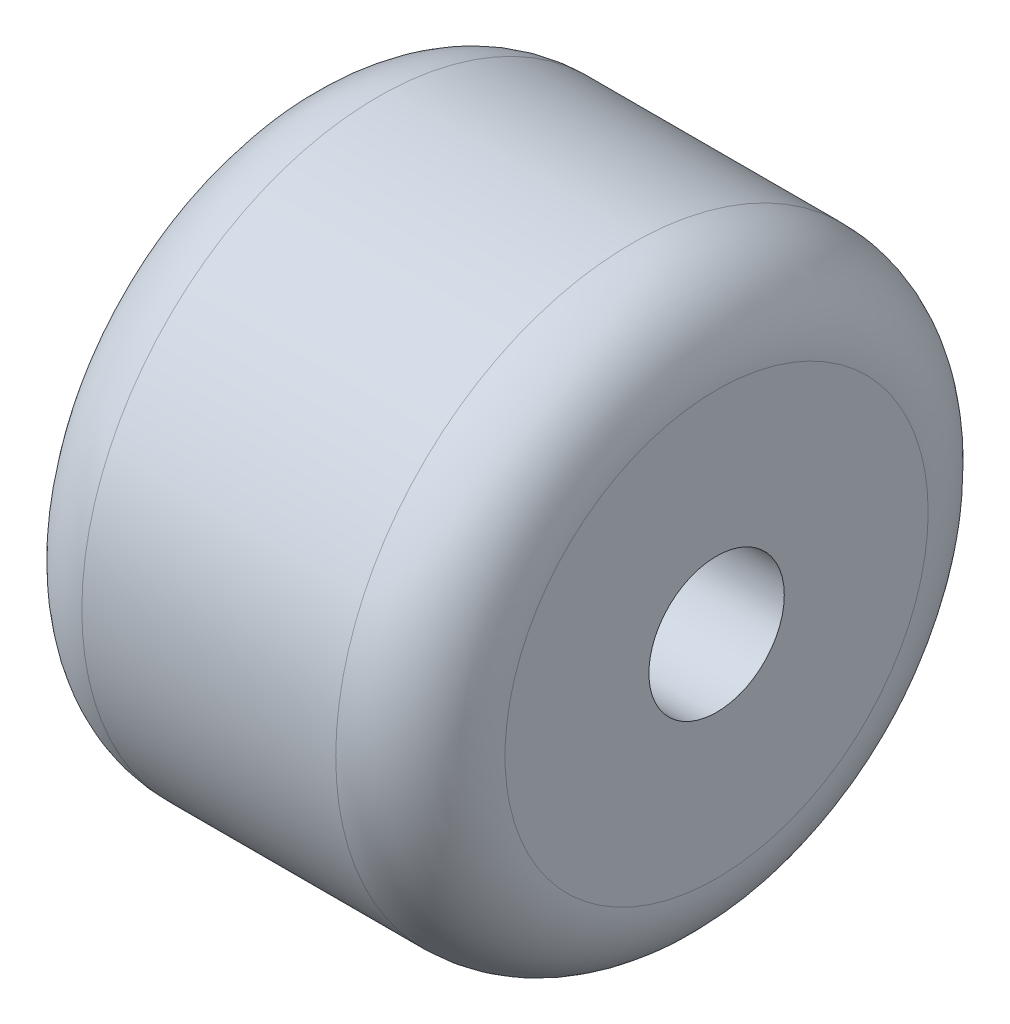
ISO-10303-21;
HEADER;
FILE_DESCRIPTION(('STEP AP214'),'2;1');
FILE_NAME('part.step','',(''),(''),'','','');
FILE_SCHEMA(('AUTOMOTIVE_DESIGN { 1 0 10303 214 1 1 1 1 }'));
ENDSEC;
DATA;
#1=APPLICATION_CONTEXT('core data for automotive mechanical design processes');
#2=APPLICATION_PROTOCOL_DEFINITION('international standard','automotive_design',2000,#1);
#3=PRODUCT_CONTEXT('',#1,'mechanical');
#4=PRODUCT('Part','Part','',(#3));
#5=PRODUCT_RELATED_PRODUCT_CATEGORY('part','',(#4));
#6=PRODUCT_DEFINITION_FORMATION('','',#4);
#7=PRODUCT_DEFINITION_CONTEXT('part definition',#1,'design');
#8=PRODUCT_DEFINITION('design','',#6,#7);
#9=PRODUCT_DEFINITION_SHAPE('','',#8);
#10=(LENGTH_UNIT() NAMED_UNIT(*) SI_UNIT(.MILLI.,.METRE.));
#11=(NAMED_UNIT(*) PLANE_ANGLE_UNIT() SI_UNIT($,.RADIAN.));
#12=(NAMED_UNIT(*) SI_UNIT($,.STERADIAN.) SOLID_ANGLE_UNIT());
#13=UNCERTAINTY_MEASURE_WITH_UNIT(LENGTH_MEASURE(1.E-05),#10,'distance_accuracy_value','');
#14=(GEOMETRIC_REPRESENTATION_CONTEXT(3) GLOBAL_UNCERTAINTY_ASSIGNED_CONTEXT((#13)) GLOBAL_UNIT_ASSIGNED_CONTEXT((#10,
#11,#12)) REPRESENTATION_CONTEXT('',''));
#15=CARTESIAN_POINT('',(0.,0.,0.));
#16=DIRECTION('',(0.,0.,1.));
#17=DIRECTION('',(1.,0.,0.));
#18=AXIS2_PLACEMENT_3D('',#15,#16,#17);
#19=CARTESIAN_POINT('',(25.,0.,0.));
#20=DIRECTION('',(1.,0.,0.));
#21=DIRECTION('',(0.,0.,-1.));
#22=AXIS2_PLACEMENT_3D('',#19,#20,#21);
#23=PLANE('',#22);
#24=CARTESIAN_POINT('',(25.,0.,0.));
#25=DIRECTION('',(1.,0.,0.));
#26=DIRECTION('',(0.,0.,-1.));
#27=AXIS2_PLACEMENT_3D('',#24,#25,#26);
#28=CIRCLE('',#27,12.5);
#29=CARTESIAN_POINT('',(25.,0.,-12.5));
#30=VERTEX_POINT('',#29);
#31=EDGE_CURVE('E10',#30,#30,#28,.T.);
#32=ORIENTED_EDGE('',*,*,#31,.T.);
#33=EDGE_LOOP('',(#32));
#34=FACE_BOUND('',#33,.T.);
#35=CARTESIAN_POINT('',(25.,0.,0.));
#36=DIRECTION('',(1.,0.,0.));
#37=DIRECTION('',(0.,0.,-1.));
#38=AXIS2_PLACEMENT_3D('',#35,#36,#37);
#39=CIRCLE('',#38,4.);
#40=CARTESIAN_POINT('',(25.,0.,-4.));
#41=VERTEX_POINT('',#40);
#42=EDGE_CURVE('E61',#41,#41,#39,.T.);
#43=ORIENTED_EDGE('',*,*,#42,.F.);
#44=EDGE_LOOP('',(#43));
#45=FACE_BOUND('',#44,.T.);
#46=ADVANCED_FACE('F37',(#34,#45),#23,.T.);
#47=CARTESIAN_POINT('',(0.,0.,0.));
#48=DIRECTION('',(1.,0.,0.));
#49=DIRECTION('',(0.,0.,-1.));
#50=AXIS2_PLACEMENT_3D('',#47,#48,#49);
#51=PLANE('',#50);
#52=CARTESIAN_POINT('',(0.,0.,0.));
#53=DIRECTION('',(1.,0.,0.));
#54=DIRECTION('',(0.,0.,-1.));
#55=AXIS2_PLACEMENT_3D('',#52,#53,#54);
#56=CIRCLE('',#55,12.5);
#57=CARTESIAN_POINT('',(0.,0.,-12.5));
#58=VERTEX_POINT('',#57);
#59=EDGE_CURVE('E45',#58,#58,#56,.F.);
#60=ORIENTED_EDGE('',*,*,#59,.T.);
#61=EDGE_LOOP('',(#60));
#62=FACE_BOUND('',#61,.T.);
#63=CARTESIAN_POINT('',(0.,0.,0.));
#64=DIRECTION('',(1.,0.,0.));
#65=DIRECTION('',(0.,0.,-1.));
#66=AXIS2_PLACEMENT_3D('',#63,#64,#65);
#67=CIRCLE('',#66,4.);
#68=CARTESIAN_POINT('',(0.,0.,-4.));
#69=VERTEX_POINT('',#68);
#70=EDGE_CURVE('E62',#69,#69,#67,.T.);
#71=ORIENTED_EDGE('',*,*,#70,.T.);
#72=EDGE_LOOP('',(#71));
#73=FACE_BOUND('',#72,.T.);
#74=ADVANCED_FACE('F74',(#62,#73),#51,.F.);
#75=CARTESIAN_POINT('',(25.,0.,0.));
#76=DIRECTION('',(-1.,0.,0.));
#77=DIRECTION('',(0.,0.,1.));
#78=AXIS2_PLACEMENT_3D('',#75,#76,#77);
#79=CYLINDRICAL_SURFACE('',#78,17.5);
#80=CARTESIAN_POINT('',(5.,0.,0.));
#81=DIRECTION('',(1.,0.,0.));
#82=DIRECTION('',(0.,0.,-1.));
#83=AXIS2_PLACEMENT_3D('',#80,#81,#82);
#84=CIRCLE('',#83,17.5);
#85=CARTESIAN_POINT('',(5.,0.,-17.5));
#86=VERTEX_POINT('',#85);
#87=EDGE_CURVE('E50',#86,#86,#84,.T.);
#88=ORIENTED_EDGE('',*,*,#87,.T.);
#89=EDGE_LOOP('',(#88));
#90=FACE_BOUND('',#89,.T.);
#91=CARTESIAN_POINT('',(20.,0.,0.));
#92=DIRECTION('',(1.,0.,0.));
#93=DIRECTION('',(0.,0.,-1.));
#94=AXIS2_PLACEMENT_3D('',#91,#92,#93);
#95=CIRCLE('',#94,17.5);
#96=CARTESIAN_POINT('',(20.,0.,-17.5));
#97=VERTEX_POINT('',#96);
#98=EDGE_CURVE('E55',#97,#97,#95,.F.);
#99=ORIENTED_EDGE('',*,*,#98,.T.);
#100=EDGE_LOOP('',(#99));
#101=FACE_BOUND('',#100,.T.);
#102=ADVANCED_FACE('F79',(#90,#101),#79,.T.);
#103=CARTESIAN_POINT('',(25.,0.,0.));
#104=DIRECTION('',(-1.,0.,0.));
#105=DIRECTION('',(0.,0.,1.));
#106=AXIS2_PLACEMENT_3D('',#103,#104,#105);
#107=CYLINDRICAL_SURFACE('',#106,4.);
#108=ORIENTED_EDGE('',*,*,#42,.T.);
#109=EDGE_LOOP('',(#108));
#110=FACE_BOUND('',#109,.T.);
#111=ORIENTED_EDGE('',*,*,#70,.F.);
#112=EDGE_LOOP('',(#111));
#113=FACE_BOUND('',#112,.T.);
#114=ADVANCED_FACE('F70',(#110,#113),#107,.F.);
#115=CARTESIAN_POINT('',(5.,0.,0.));
#116=DIRECTION('',(1.,0.,0.));
#117=DIRECTION('',(0.,0.,-1.));
#118=AXIS2_PLACEMENT_3D('',#115,#116,#117);
#119=TOROIDAL_SURFACE('',#118,12.5,5.);
#120=ORIENTED_EDGE('',*,*,#59,.F.);
#121=EDGE_LOOP('',(#120));
#122=FACE_BOUND('',#121,.T.);
#123=ORIENTED_EDGE('',*,*,#87,.F.);
#124=EDGE_LOOP('',(#123));
#125=FACE_BOUND('',#124,.T.);
#126=ADVANCED_FACE('F85',(#122,#125),#119,.T.);
#127=CARTESIAN_POINT('',(20.,0.,0.));
#128=DIRECTION('',(1.,0.,0.));
#129=DIRECTION('',(0.,0.,-1.));
#130=AXIS2_PLACEMENT_3D('',#127,#128,#129);
#131=TOROIDAL_SURFACE('',#130,12.5,5.);
#132=ORIENTED_EDGE('',*,*,#98,.F.);
#133=EDGE_LOOP('',(#132));
#134=FACE_BOUND('',#133,.T.);
#135=ORIENTED_EDGE('',*,*,#31,.F.);
#136=EDGE_LOOP('',(#135));
#137=FACE_BOUND('',#136,.T.);
#138=ADVANCED_FACE('F39',(#134,#137),#131,.T.);
#139=CLOSED_SHELL('',(#46,#74,#102,#114,#126,#138));
#140=MANIFOLD_SOLID_BREP('B2',#139);
#141=ADVANCED_BREP_SHAPE_REPRESENTATION('',(#18,#140),#14);
#142=SHAPE_DEFINITION_REPRESENTATION(#9,#141);
ENDSEC;
END-ISO-10303-21;
